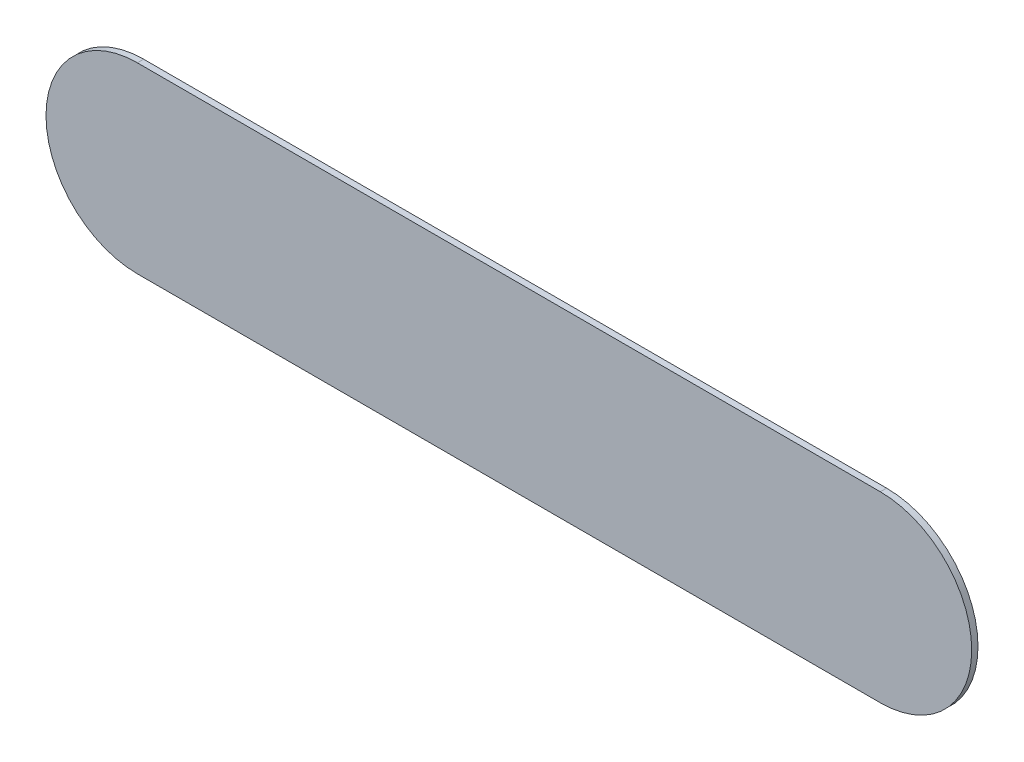
ISO-10303-21;
HEADER;
FILE_DESCRIPTION(('STEP AP214'),'2;1');
FILE_NAME('part.step','',(''),(''),'','','');
FILE_SCHEMA(('AUTOMOTIVE_DESIGN { 1 0 10303 214 1 1 1 1 }'));
ENDSEC;
DATA;
#1=APPLICATION_CONTEXT('core data for automotive mechanical design processes');
#2=APPLICATION_PROTOCOL_DEFINITION('international standard','automotive_design',2000,#1);
#3=PRODUCT_CONTEXT('',#1,'mechanical');
#4=PRODUCT('Part','Part','',(#3));
#5=PRODUCT_RELATED_PRODUCT_CATEGORY('part','',(#4));
#6=PRODUCT_DEFINITION_FORMATION('','',#4);
#7=PRODUCT_DEFINITION_CONTEXT('part definition',#1,'design');
#8=PRODUCT_DEFINITION('design','',#6,#7);
#9=PRODUCT_DEFINITION_SHAPE('','',#8);
#10=(LENGTH_UNIT() NAMED_UNIT(*) SI_UNIT(.MILLI.,.METRE.));
#11=(NAMED_UNIT(*) PLANE_ANGLE_UNIT() SI_UNIT($,.RADIAN.));
#12=(NAMED_UNIT(*) SI_UNIT($,.STERADIAN.) SOLID_ANGLE_UNIT());
#13=UNCERTAINTY_MEASURE_WITH_UNIT(LENGTH_MEASURE(1.E-05),#10,'distance_accuracy_value','');
#14=(GEOMETRIC_REPRESENTATION_CONTEXT(3) GLOBAL_UNCERTAINTY_ASSIGNED_CONTEXT((#13)) GLOBAL_UNIT_ASSIGNED_CONTEXT((#10,
#11,#12)) REPRESENTATION_CONTEXT('',''));
#15=CARTESIAN_POINT('',(0.,0.,0.));
#16=DIRECTION('',(0.,0.,1.));
#17=DIRECTION('',(1.,0.,0.));
#18=AXIS2_PLACEMENT_3D('',#15,#16,#17);
#19=CARTESIAN_POINT('',(0.,0.,-0.65));
#20=DIRECTION('',(0.,0.,1.));
#21=DIRECTION('',(1.,0.,0.));
#22=AXIS2_PLACEMENT_3D('',#19,#20,#21);
#23=PLANE('',#22);
#24=DIRECTION('',(1.,0.,0.));
#25=VECTOR('',#24,1.);
#26=CARTESIAN_POINT('',(0.,-7.995,-0.65));
#27=LINE('',#26,#25);
#28=CARTESIAN_POINT('',(-32.5,-7.995,-0.65));
#29=VERTEX_POINT('',#28);
#30=CARTESIAN_POINT('',(32.5,-7.995,-0.65));
#31=VERTEX_POINT('',#30);
#32=EDGE_CURVE('E52',#29,#31,#27,.T.);
#33=ORIENTED_EDGE('',*,*,#32,.F.);
#34=CARTESIAN_POINT('',(-32.5,0.,-0.65));
#35=DIRECTION('',(0.,0.,1.));
#36=DIRECTION('',(1.,0.,0.));
#37=AXIS2_PLACEMENT_3D('',#34,#35,#36);
#38=CIRCLE('',#37,7.995);
#39=CARTESIAN_POINT('',(-32.5,7.995,-0.65));
#40=VERTEX_POINT('',#39);
#41=EDGE_CURVE('E20',#40,#29,#38,.T.);
#42=ORIENTED_EDGE('',*,*,#41,.F.);
#43=DIRECTION('',(1.,0.,0.));
#44=VECTOR('',#43,1.);
#45=CARTESIAN_POINT('',(0.,7.995,-0.65));
#46=LINE('',#45,#44);
#47=CARTESIAN_POINT('',(32.5,7.995,-0.65));
#48=VERTEX_POINT('',#47);
#49=EDGE_CURVE('E55',#48,#40,#46,.F.);
#50=ORIENTED_EDGE('',*,*,#49,.F.);
#51=CARTESIAN_POINT('',(32.5,0.,-0.65));
#52=DIRECTION('',(0.,0.,1.));
#53=DIRECTION('',(1.,0.,0.));
#54=AXIS2_PLACEMENT_3D('',#51,#52,#53);
#55=CIRCLE('',#54,7.995);
#56=EDGE_CURVE('E85',#31,#48,#55,.T.);
#57=ORIENTED_EDGE('',*,*,#56,.F.);
#58=EDGE_LOOP('',(#33,#42,#50,#57));
#59=FACE_BOUND('',#58,.T.);
#60=ADVANCED_FACE('F17',(#59),#23,.F.);
#61=CARTESIAN_POINT('',(0.,7.995,-0.1));
#62=DIRECTION('',(0.,1.,0.));
#63=DIRECTION('',(0.,0.,1.));
#64=AXIS2_PLACEMENT_3D('',#61,#62,#63);
#65=PLANE('',#64);
#66=DIRECTION('',(0.,0.,1.));
#67=VECTOR('',#66,1.);
#68=CARTESIAN_POINT('',(-32.5,7.995,-0.1));
#69=LINE('',#68,#67);
#70=CARTESIAN_POINT('',(-32.5,7.995,-0.1));
#71=VERTEX_POINT('',#70);
#72=EDGE_CURVE('E62',#71,#40,#69,.F.);
#73=ORIENTED_EDGE('',*,*,#72,.F.);
#74=DIRECTION('',(1.,0.,0.));
#75=VECTOR('',#74,1.);
#76=CARTESIAN_POINT('',(0.,7.995,-0.1));
#77=LINE('',#76,#75);
#78=CARTESIAN_POINT('',(32.5,7.995,-0.1));
#79=VERTEX_POINT('',#78);
#80=EDGE_CURVE('E84',#79,#71,#77,.F.);
#81=ORIENTED_EDGE('',*,*,#80,.F.);
#82=DIRECTION('',(0.,0.,1.));
#83=VECTOR('',#82,1.);
#84=CARTESIAN_POINT('',(32.5,7.995,-0.1));
#85=LINE('',#84,#83);
#86=EDGE_CURVE('E69',#48,#79,#85,.T.);
#87=ORIENTED_EDGE('',*,*,#86,.F.);
#88=ORIENTED_EDGE('',*,*,#49,.T.);
#89=EDGE_LOOP('',(#73,#81,#87,#88));
#90=FACE_BOUND('',#89,.T.);
#91=ADVANCED_FACE('F65',(#90),#65,.T.);
#92=CARTESIAN_POINT('',(-32.5,0.,-0.1));
#93=DIRECTION('',(0.,0.,1.));
#94=DIRECTION('',(1.,0.,0.));
#95=AXIS2_PLACEMENT_3D('',#92,#93,#94);
#96=CYLINDRICAL_SURFACE('',#95,7.995);
#97=DIRECTION('',(0.,0.,-1.));
#98=VECTOR('',#97,1.);
#99=CARTESIAN_POINT('',(-32.5,-7.995,-0.1));
#100=LINE('',#99,#98);
#101=CARTESIAN_POINT('',(-32.5,-7.995,-0.1));
#102=VERTEX_POINT('',#101);
#103=EDGE_CURVE('E61',#102,#29,#100,.T.);
#104=ORIENTED_EDGE('',*,*,#103,.F.);
#105=CARTESIAN_POINT('',(-32.5,0.,-0.1));
#106=DIRECTION('',(0.,0.,1.));
#107=DIRECTION('',(1.,0.,0.));
#108=AXIS2_PLACEMENT_3D('',#105,#106,#107);
#109=CIRCLE('',#108,7.995);
#110=EDGE_CURVE('E73',#71,#102,#109,.T.);
#111=ORIENTED_EDGE('',*,*,#110,.F.);
#112=ORIENTED_EDGE('',*,*,#72,.T.);
#113=ORIENTED_EDGE('',*,*,#41,.T.);
#114=EDGE_LOOP('',(#104,#111,#112,#113));
#115=FACE_BOUND('',#114,.T.);
#116=ADVANCED_FACE('F72',(#115),#96,.T.);
#117=CARTESIAN_POINT('',(0.,-7.995,-0.1));
#118=DIRECTION('',(0.,-1.,0.));
#119=DIRECTION('',(0.,0.,-1.));
#120=AXIS2_PLACEMENT_3D('',#117,#118,#119);
#121=PLANE('',#120);
#122=DIRECTION('',(0.,0.,1.));
#123=VECTOR('',#122,1.);
#124=CARTESIAN_POINT('',(32.5,-7.995,-0.1));
#125=LINE('',#124,#123);
#126=CARTESIAN_POINT('',(32.5,-7.995,-0.1));
#127=VERTEX_POINT('',#126);
#128=EDGE_CURVE('E79',#127,#31,#125,.F.);
#129=ORIENTED_EDGE('',*,*,#128,.F.);
#130=DIRECTION('',(1.,0.,0.));
#131=VECTOR('',#130,1.);
#132=CARTESIAN_POINT('',(0.,-7.995,-0.1));
#133=LINE('',#132,#131);
#134=EDGE_CURVE('E26',#102,#127,#133,.T.);
#135=ORIENTED_EDGE('',*,*,#134,.F.);
#136=ORIENTED_EDGE('',*,*,#103,.T.);
#137=ORIENTED_EDGE('',*,*,#32,.T.);
#138=EDGE_LOOP('',(#129,#135,#136,#137));
#139=FACE_BOUND('',#138,.T.);
#140=ADVANCED_FACE('F99',(#139),#121,.T.);
#141=CARTESIAN_POINT('',(32.5,0.,-0.1));
#142=DIRECTION('',(0.,0.,1.));
#143=DIRECTION('',(1.,0.,0.));
#144=AXIS2_PLACEMENT_3D('',#141,#142,#143);
#145=CYLINDRICAL_SURFACE('',#144,7.995);
#146=ORIENTED_EDGE('',*,*,#86,.T.);
#147=CARTESIAN_POINT('',(32.5,0.,-0.1));
#148=DIRECTION('',(0.,0.,1.));
#149=DIRECTION('',(1.,0.,0.));
#150=AXIS2_PLACEMENT_3D('',#147,#148,#149);
#151=CIRCLE('',#150,7.995);
#152=EDGE_CURVE('E11',#127,#79,#151,.T.);
#153=ORIENTED_EDGE('',*,*,#152,.F.);
#154=ORIENTED_EDGE('',*,*,#128,.T.);
#155=ORIENTED_EDGE('',*,*,#56,.T.);
#156=EDGE_LOOP('',(#146,#153,#154,#155));
#157=FACE_BOUND('',#156,.T.);
#158=ADVANCED_FACE('F97',(#157),#145,.T.);
#159=CARTESIAN_POINT('',(0.,0.,-0.1));
#160=DIRECTION('',(0.,0.,1.));
#161=DIRECTION('',(1.,0.,0.));
#162=AXIS2_PLACEMENT_3D('',#159,#160,#161);
#163=PLANE('',#162);
#164=ORIENTED_EDGE('',*,*,#152,.T.);
#165=ORIENTED_EDGE('',*,*,#80,.T.);
#166=ORIENTED_EDGE('',*,*,#110,.T.);
#167=ORIENTED_EDGE('',*,*,#134,.T.);
#168=EDGE_LOOP('',(#164,#165,#166,#167));
#169=FACE_BOUND('',#168,.T.);
#170=ADVANCED_FACE('F96',(#169),#163,.T.);
#171=CLOSED_SHELL('',(#60,#91,#116,#140,#158,#170));
#172=MANIFOLD_SOLID_BREP('B1',#171);
#173=ADVANCED_BREP_SHAPE_REPRESENTATION('',(#18,#172),#14);
#174=SHAPE_DEFINITION_REPRESENTATION(#9,#173);
ENDSEC;
END-ISO-10303-21;
